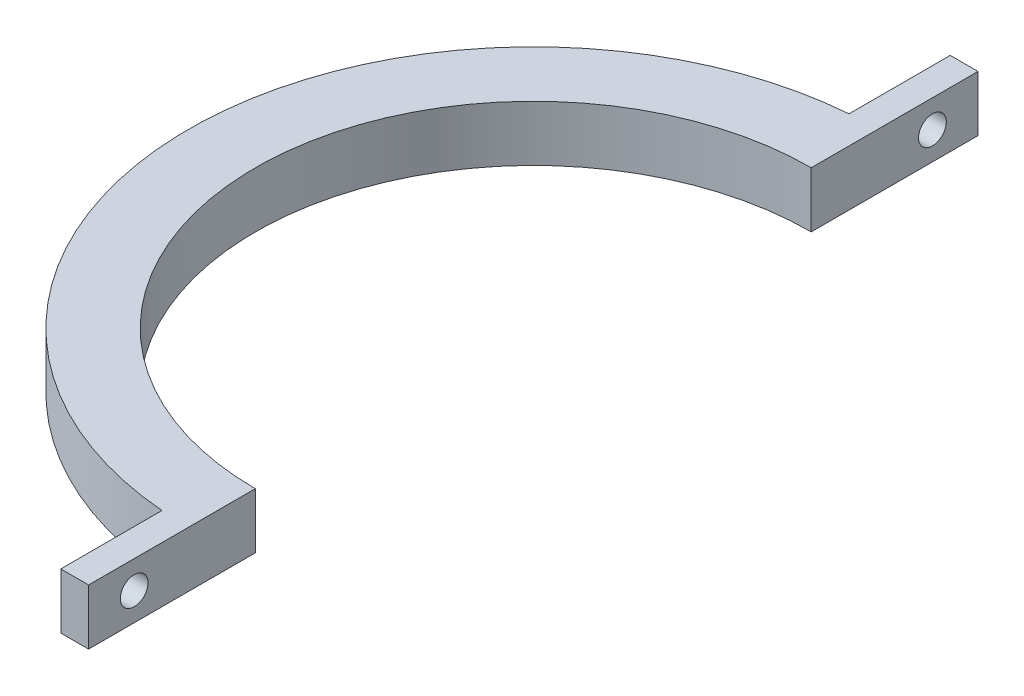
ISO-10303-21;
HEADER;
FILE_DESCRIPTION(('STEP AP214'),'2;1');
FILE_NAME('part.step','',(''),(''),'','','');
FILE_SCHEMA(('AUTOMOTIVE_DESIGN { 1 0 10303 214 1 1 1 1 }'));
ENDSEC;
DATA;
#1=APPLICATION_CONTEXT('core data for automotive mechanical design processes');
#2=APPLICATION_PROTOCOL_DEFINITION('international standard','automotive_design',2000,#1);
#3=PRODUCT_CONTEXT('',#1,'mechanical');
#4=PRODUCT('Part','Part','',(#3));
#5=PRODUCT_RELATED_PRODUCT_CATEGORY('part','',(#4));
#6=PRODUCT_DEFINITION_FORMATION('','',#4);
#7=PRODUCT_DEFINITION_CONTEXT('part definition',#1,'design');
#8=PRODUCT_DEFINITION('design','',#6,#7);
#9=PRODUCT_DEFINITION_SHAPE('','',#8);
#10=(LENGTH_UNIT() NAMED_UNIT(*) SI_UNIT(.MILLI.,.METRE.));
#11=(NAMED_UNIT(*) PLANE_ANGLE_UNIT() SI_UNIT($,.RADIAN.));
#12=(NAMED_UNIT(*) SI_UNIT($,.STERADIAN.) SOLID_ANGLE_UNIT());
#13=UNCERTAINTY_MEASURE_WITH_UNIT(LENGTH_MEASURE(1.E-05),#10,'distance_accuracy_value','');
#14=(GEOMETRIC_REPRESENTATION_CONTEXT(3) GLOBAL_UNCERTAINTY_ASSIGNED_CONTEXT((#13)) GLOBAL_UNIT_ASSIGNED_CONTEXT((#10,
#11,#12)) REPRESENTATION_CONTEXT('',''));
#15=CARTESIAN_POINT('',(0.,0.,0.));
#16=DIRECTION('',(0.,0.,1.));
#17=DIRECTION('',(1.,0.,0.));
#18=AXIS2_PLACEMENT_3D('',#15,#16,#17);
#19=CARTESIAN_POINT('',(0.,5.,0.));
#20=DIRECTION('',(0.,-1.,0.));
#21=DIRECTION('',(0.,0.,-1.));
#22=AXIS2_PLACEMENT_3D('',#19,#20,#21);
#23=CYLINDRICAL_SURFACE('',#22,25.);
#24=CARTESIAN_POINT('',(0.,0.,0.));
#25=DIRECTION('',(0.,1.,0.));
#26=DIRECTION('',(0.,0.,1.));
#27=AXIS2_PLACEMENT_3D('',#24,#25,#26);
#28=CIRCLE('',#27,25.);
#29=CARTESIAN_POINT('',(0.,0.,-25.));
#30=VERTEX_POINT('',#29);
#31=CARTESIAN_POINT('',(0.,0.,25.));
#32=VERTEX_POINT('',#31);
#33=EDGE_CURVE('E139',#30,#32,#28,.T.);
#34=ORIENTED_EDGE('',*,*,#33,.F.);
#35=DIRECTION('',(0.,-1.,0.));
#36=VECTOR('',#35,1.);
#37=CARTESIAN_POINT('',(0.,5.,-25.));
#38=LINE('',#37,#36);
#39=CARTESIAN_POINT('',(0.,5.,-25.));
#40=VERTEX_POINT('',#39);
#41=EDGE_CURVE('E11',#40,#30,#38,.T.);
#42=ORIENTED_EDGE('',*,*,#41,.F.);
#43=CARTESIAN_POINT('',(0.,5.,0.));
#44=DIRECTION('',(0.,1.,0.));
#45=DIRECTION('',(0.,0.,1.));
#46=AXIS2_PLACEMENT_3D('',#43,#44,#45);
#47=CIRCLE('',#46,25.);
#48=CARTESIAN_POINT('',(0.,5.,25.));
#49=VERTEX_POINT('',#48);
#50=EDGE_CURVE('E165',#40,#49,#47,.T.);
#51=ORIENTED_EDGE('',*,*,#50,.T.);
#52=DIRECTION('',(0.,-1.,0.));
#53=VECTOR('',#52,1.);
#54=CARTESIAN_POINT('',(0.,5.,25.));
#55=LINE('',#54,#53);
#56=EDGE_CURVE('E58',#49,#32,#55,.T.);
#57=ORIENTED_EDGE('',*,*,#56,.T.);
#58=EDGE_LOOP('',(#34,#42,#51,#57));
#59=FACE_BOUND('',#58,.T.);
#60=ADVANCED_FACE('F41',(#59),#23,.F.);
#61=CARTESIAN_POINT('',(0.,5.,0.));
#62=DIRECTION('',(-1.,0.,0.));
#63=DIRECTION('',(0.,0.,1.));
#64=AXIS2_PLACEMENT_3D('',#61,#62,#63);
#65=PLANE('',#64);
#66=CARTESIAN_POINT('',(0.,2.5,-35.8990291109608));
#67=DIRECTION('',(-1.,0.,0.));
#68=DIRECTION('',(0.,0.,1.));
#69=AXIS2_PLACEMENT_3D('',#66,#67,#68);
#70=CIRCLE('',#69,1.25);
#71=CARTESIAN_POINT('',(0.,2.5,-34.6490291109608));
#72=VERTEX_POINT('',#71);
#73=EDGE_CURVE('E143',#72,#72,#70,.T.);
#74=ORIENTED_EDGE('',*,*,#73,.T.);
#75=EDGE_LOOP('',(#74));
#76=FACE_BOUND('',#75,.T.);
#77=DIRECTION('',(0.,0.,-1.));
#78=VECTOR('',#77,1.);
#79=CARTESIAN_POINT('',(0.,0.,0.));
#80=LINE('',#79,#78);
#81=CARTESIAN_POINT('',(0.,0.,-40.));
#82=VERTEX_POINT('',#81);
#83=EDGE_CURVE('E142',#30,#82,#80,.T.);
#84=ORIENTED_EDGE('',*,*,#83,.T.);
#85=DIRECTION('',(0.,-1.,0.));
#86=VECTOR('',#85,1.);
#87=CARTESIAN_POINT('',(0.,5.,-40.));
#88=LINE('',#87,#86);
#89=CARTESIAN_POINT('',(0.,5.,-40.));
#90=VERTEX_POINT('',#89);
#91=EDGE_CURVE('E50',#90,#82,#88,.T.);
#92=ORIENTED_EDGE('',*,*,#91,.F.);
#93=DIRECTION('',(0.,0.,-1.));
#94=VECTOR('',#93,1.);
#95=CARTESIAN_POINT('',(0.,5.,0.));
#96=LINE('',#95,#94);
#97=EDGE_CURVE('E207',#40,#90,#96,.T.);
#98=ORIENTED_EDGE('',*,*,#97,.F.);
#99=ORIENTED_EDGE('',*,*,#41,.T.);
#100=EDGE_LOOP('',(#84,#92,#98,#99));
#101=FACE_BOUND('',#100,.T.);
#102=ADVANCED_FACE('F228',(#76,#101),#65,.F.);
#103=CARTESIAN_POINT('',(0.,5.,-40.));
#104=DIRECTION('',(0.,0.,1.));
#105=DIRECTION('',(1.,0.,0.));
#106=AXIS2_PLACEMENT_3D('',#103,#104,#105);
#107=PLANE('',#106);
#108=DIRECTION('',(-1.,0.,0.));
#109=VECTOR('',#108,1.);
#110=CARTESIAN_POINT('',(0.,0.,-40.));
#111=LINE('',#110,#109);
#112=CARTESIAN_POINT('',(-2.5,0.,-40.));
#113=VERTEX_POINT('',#112);
#114=EDGE_CURVE('E146',#82,#113,#111,.T.);
#115=ORIENTED_EDGE('',*,*,#114,.T.);
#116=DIRECTION('',(0.,-1.,0.));
#117=VECTOR('',#116,1.);
#118=CARTESIAN_POINT('',(-2.5,5.,-40.));
#119=LINE('',#118,#117);
#120=CARTESIAN_POINT('',(-2.5,5.,-40.));
#121=VERTEX_POINT('',#120);
#122=EDGE_CURVE('E176',#121,#113,#119,.T.);
#123=ORIENTED_EDGE('',*,*,#122,.F.);
#124=DIRECTION('',(-1.,0.,0.));
#125=VECTOR('',#124,1.);
#126=CARTESIAN_POINT('',(0.,5.,-40.));
#127=LINE('',#126,#125);
#128=EDGE_CURVE('E187',#90,#121,#127,.T.);
#129=ORIENTED_EDGE('',*,*,#128,.F.);
#130=ORIENTED_EDGE('',*,*,#91,.T.);
#131=EDGE_LOOP('',(#115,#123,#129,#130));
#132=FACE_BOUND('',#131,.T.);
#133=ADVANCED_FACE('F185',(#132),#107,.F.);
#134=CARTESIAN_POINT('',(-2.5,5.,0.));
#135=DIRECTION('',(1.,0.,0.));
#136=DIRECTION('',(0.,0.,-1.));
#137=AXIS2_PLACEMENT_3D('',#134,#135,#136);
#138=PLANE('',#137);
#139=CARTESIAN_POINT('',(-2.5,2.5,-35.8990291109608));
#140=DIRECTION('',(-1.,0.,0.));
#141=DIRECTION('',(0.,0.,1.));
#142=AXIS2_PLACEMENT_3D('',#139,#140,#141);
#143=CIRCLE('',#142,1.25);
#144=CARTESIAN_POINT('',(-2.5,2.5,-34.6490291109608));
#145=VERTEX_POINT('',#144);
#146=EDGE_CURVE('E220',#145,#145,#143,.T.);
#147=ORIENTED_EDGE('',*,*,#146,.F.);
#148=EDGE_LOOP('',(#147));
#149=FACE_BOUND('',#148,.T.);
#150=DIRECTION('',(0.,0.,1.));
#151=VECTOR('',#150,1.);
#152=CARTESIAN_POINT('',(-2.5,0.,0.));
#153=LINE('',#152,#151);
#154=CARTESIAN_POINT('',(-2.5,0.,-30.8990291109608));
#155=VERTEX_POINT('',#154);
#156=EDGE_CURVE('E149',#113,#155,#153,.T.);
#157=ORIENTED_EDGE('',*,*,#156,.T.);
#158=DIRECTION('',(0.,-1.,0.));
#159=VECTOR('',#158,1.);
#160=CARTESIAN_POINT('',(-2.5,5.,-30.8990291109608));
#161=LINE('',#160,#159);
#162=CARTESIAN_POINT('',(-2.5,5.,-30.8990291109608));
#163=VERTEX_POINT('',#162);
#164=EDGE_CURVE('E172',#163,#155,#161,.T.);
#165=ORIENTED_EDGE('',*,*,#164,.F.);
#166=DIRECTION('',(0.,0.,1.));
#167=VECTOR('',#166,1.);
#168=CARTESIAN_POINT('',(-2.5,5.,0.));
#169=LINE('',#168,#167);
#170=EDGE_CURVE('E201',#121,#163,#169,.T.);
#171=ORIENTED_EDGE('',*,*,#170,.F.);
#172=ORIENTED_EDGE('',*,*,#122,.T.);
#173=EDGE_LOOP('',(#157,#165,#171,#172));
#174=FACE_BOUND('',#173,.T.);
#175=ADVANCED_FACE('F196',(#149,#174),#138,.F.);
#176=CARTESIAN_POINT('',(0.,5.,0.));
#177=DIRECTION('',(0.,-1.,0.));
#178=DIRECTION('',(0.,0.,-1.));
#179=AXIS2_PLACEMENT_3D('',#176,#177,#178);
#180=CYLINDRICAL_SURFACE('',#179,31.);
#181=CARTESIAN_POINT('',(0.,0.,0.));
#182=DIRECTION('',(0.,1.,0.));
#183=DIRECTION('',(0.,0.,1.));
#184=AXIS2_PLACEMENT_3D('',#181,#182,#183);
#185=CIRCLE('',#184,31.);
#186=CARTESIAN_POINT('',(-2.5,0.,30.8990291109608));
#187=VERTEX_POINT('',#186);
#188=EDGE_CURVE('E152',#155,#187,#185,.T.);
#189=ORIENTED_EDGE('',*,*,#188,.T.);
#190=DIRECTION('',(0.,-1.,0.));
#191=VECTOR('',#190,1.);
#192=CARTESIAN_POINT('',(-2.5,5.,30.8990291109608));
#193=LINE('',#192,#191);
#194=CARTESIAN_POINT('',(-2.5,5.,30.8990291109608));
#195=VERTEX_POINT('',#194);
#196=EDGE_CURVE('E118',#195,#187,#193,.T.);
#197=ORIENTED_EDGE('',*,*,#196,.F.);
#198=CARTESIAN_POINT('',(0.,5.,0.));
#199=DIRECTION('',(0.,1.,0.));
#200=DIRECTION('',(0.,0.,1.));
#201=AXIS2_PLACEMENT_3D('',#198,#199,#200);
#202=CIRCLE('',#201,31.);
#203=EDGE_CURVE('E127',#163,#195,#202,.T.);
#204=ORIENTED_EDGE('',*,*,#203,.F.);
#205=ORIENTED_EDGE('',*,*,#164,.T.);
#206=EDGE_LOOP('',(#189,#197,#204,#205));
#207=FACE_BOUND('',#206,.T.);
#208=ADVANCED_FACE('F199',(#207),#180,.T.);
#209=CARTESIAN_POINT('',(-2.5,5.,0.));
#210=DIRECTION('',(-1.,0.,0.));
#211=DIRECTION('',(0.,0.,1.));
#212=AXIS2_PLACEMENT_3D('',#209,#210,#211);
#213=PLANE('',#212);
#214=CARTESIAN_POINT('',(-2.5,2.5,35.8990291109608));
#215=DIRECTION('',(-1.,0.,0.));
#216=DIRECTION('',(0.,0.,-1.));
#217=AXIS2_PLACEMENT_3D('',#214,#215,#216);
#218=CIRCLE('',#217,1.25);
#219=CARTESIAN_POINT('',(-2.5,2.5,34.6490291109608));
#220=VERTEX_POINT('',#219);
#221=EDGE_CURVE('E212',#220,#220,#218,.T.);
#222=ORIENTED_EDGE('',*,*,#221,.F.);
#223=EDGE_LOOP('',(#222));
#224=FACE_BOUND('',#223,.T.);
#225=DIRECTION('',(0.,0.,-1.));
#226=VECTOR('',#225,1.);
#227=CARTESIAN_POINT('',(-2.5,0.,0.));
#228=LINE('',#227,#226);
#229=CARTESIAN_POINT('',(-2.5,0.,40.));
#230=VERTEX_POINT('',#229);
#231=EDGE_CURVE('E113',#230,#187,#228,.T.);
#232=ORIENTED_EDGE('',*,*,#231,.F.);
#233=DIRECTION('',(0.,-1.,0.));
#234=VECTOR('',#233,1.);
#235=CARTESIAN_POINT('',(-2.5,5.,40.));
#236=LINE('',#235,#234);
#237=CARTESIAN_POINT('',(-2.5,5.,40.));
#238=VERTEX_POINT('',#237);
#239=EDGE_CURVE('E108',#238,#230,#236,.T.);
#240=ORIENTED_EDGE('',*,*,#239,.F.);
#241=DIRECTION('',(0.,0.,-1.));
#242=VECTOR('',#241,1.);
#243=CARTESIAN_POINT('',(-2.5,5.,0.));
#244=LINE('',#243,#242);
#245=EDGE_CURVE('E111',#238,#195,#244,.T.);
#246=ORIENTED_EDGE('',*,*,#245,.T.);
#247=ORIENTED_EDGE('',*,*,#196,.T.);
#248=EDGE_LOOP('',(#232,#240,#246,#247));
#249=FACE_BOUND('',#248,.T.);
#250=ADVANCED_FACE('F110',(#224,#249),#213,.T.);
#251=CARTESIAN_POINT('',(0.,5.,40.));
#252=DIRECTION('',(0.,0.,1.));
#253=DIRECTION('',(1.,0.,0.));
#254=AXIS2_PLACEMENT_3D('',#251,#252,#253);
#255=PLANE('',#254);
#256=DIRECTION('',(-1.,0.,0.));
#257=VECTOR('',#256,1.);
#258=CARTESIAN_POINT('',(0.,0.,40.));
#259=LINE('',#258,#257);
#260=CARTESIAN_POINT('',(0.,0.,40.));
#261=VERTEX_POINT('',#260);
#262=EDGE_CURVE('E158',#261,#230,#259,.T.);
#263=ORIENTED_EDGE('',*,*,#262,.F.);
#264=DIRECTION('',(0.,-1.,0.));
#265=VECTOR('',#264,1.);
#266=CARTESIAN_POINT('',(0.,5.,40.));
#267=LINE('',#266,#265);
#268=CARTESIAN_POINT('',(0.,5.,40.));
#269=VERTEX_POINT('',#268);
#270=EDGE_CURVE('E83',#269,#261,#267,.T.);
#271=ORIENTED_EDGE('',*,*,#270,.F.);
#272=DIRECTION('',(-1.,0.,0.));
#273=VECTOR('',#272,1.);
#274=CARTESIAN_POINT('',(0.,5.,40.));
#275=LINE('',#274,#273);
#276=EDGE_CURVE('E125',#269,#238,#275,.T.);
#277=ORIENTED_EDGE('',*,*,#276,.T.);
#278=ORIENTED_EDGE('',*,*,#239,.T.);
#279=EDGE_LOOP('',(#263,#271,#277,#278));
#280=FACE_BOUND('',#279,.T.);
#281=ADVANCED_FACE('F131',(#280),#255,.T.);
#282=CARTESIAN_POINT('',(0.,5.,0.));
#283=DIRECTION('',(1.,0.,0.));
#284=DIRECTION('',(0.,0.,-1.));
#285=AXIS2_PLACEMENT_3D('',#282,#283,#284);
#286=PLANE('',#285);
#287=CARTESIAN_POINT('',(0.,2.5,35.8990291109608));
#288=DIRECTION('',(-1.,0.,0.));
#289=DIRECTION('',(0.,0.,-1.));
#290=AXIS2_PLACEMENT_3D('',#287,#288,#289);
#291=CIRCLE('',#290,1.25);
#292=CARTESIAN_POINT('',(0.,2.5,34.6490291109608));
#293=VERTEX_POINT('',#292);
#294=EDGE_CURVE('E216',#293,#293,#291,.T.);
#295=ORIENTED_EDGE('',*,*,#294,.T.);
#296=EDGE_LOOP('',(#295));
#297=FACE_BOUND('',#296,.T.);
#298=DIRECTION('',(0.,0.,1.));
#299=VECTOR('',#298,1.);
#300=CARTESIAN_POINT('',(0.,0.,0.));
#301=LINE('',#300,#299);
#302=EDGE_CURVE('E161',#32,#261,#301,.T.);
#303=ORIENTED_EDGE('',*,*,#302,.F.);
#304=ORIENTED_EDGE('',*,*,#56,.F.);
#305=DIRECTION('',(0.,0.,1.));
#306=VECTOR('',#305,1.);
#307=CARTESIAN_POINT('',(0.,5.,0.));
#308=LINE('',#307,#306);
#309=EDGE_CURVE('E133',#49,#269,#308,.T.);
#310=ORIENTED_EDGE('',*,*,#309,.T.);
#311=ORIENTED_EDGE('',*,*,#270,.T.);
#312=EDGE_LOOP('',(#303,#304,#310,#311));
#313=FACE_BOUND('',#312,.T.);
#314=ADVANCED_FACE('F249',(#297,#313),#286,.T.);
#315=CARTESIAN_POINT('',(0.,5.,0.));
#316=DIRECTION('',(0.,1.,0.));
#317=DIRECTION('',(0.,0.,1.));
#318=AXIS2_PLACEMENT_3D('',#315,#316,#317);
#319=PLANE('',#318);
#320=ORIENTED_EDGE('',*,*,#50,.F.);
#321=ORIENTED_EDGE('',*,*,#97,.T.);
#322=ORIENTED_EDGE('',*,*,#128,.T.);
#323=ORIENTED_EDGE('',*,*,#170,.T.);
#324=ORIENTED_EDGE('',*,*,#203,.T.);
#325=ORIENTED_EDGE('',*,*,#245,.F.);
#326=ORIENTED_EDGE('',*,*,#276,.F.);
#327=ORIENTED_EDGE('',*,*,#309,.F.);
#328=EDGE_LOOP('',(#320,#321,#322,#323,#324,#325,#326,#327));
#329=FACE_BOUND('',#328,.T.);
#330=ADVANCED_FACE('F123',(#329),#319,.T.);
#331=CARTESIAN_POINT('',(0.,0.,0.));
#332=DIRECTION('',(0.,1.,0.));
#333=DIRECTION('',(0.,0.,1.));
#334=AXIS2_PLACEMENT_3D('',#331,#332,#333);
#335=PLANE('',#334);
#336=ORIENTED_EDGE('',*,*,#33,.T.);
#337=ORIENTED_EDGE('',*,*,#302,.T.);
#338=ORIENTED_EDGE('',*,*,#262,.T.);
#339=ORIENTED_EDGE('',*,*,#231,.T.);
#340=ORIENTED_EDGE('',*,*,#188,.F.);
#341=ORIENTED_EDGE('',*,*,#156,.F.);
#342=ORIENTED_EDGE('',*,*,#114,.F.);
#343=ORIENTED_EDGE('',*,*,#83,.F.);
#344=EDGE_LOOP('',(#336,#337,#338,#339,#340,#341,#342,#343));
#345=FACE_BOUND('',#344,.T.);
#346=ADVANCED_FACE('F192',(#345),#335,.F.);
#347=CARTESIAN_POINT('',(0.,2.5,35.8990291109608));
#348=DIRECTION('',(-1.,0.,0.));
#349=DIRECTION('',(0.,0.,1.));
#350=AXIS2_PLACEMENT_3D('',#347,#348,#349);
#351=CYLINDRICAL_SURFACE('',#350,1.25);
#352=ORIENTED_EDGE('',*,*,#294,.F.);
#353=EDGE_LOOP('',(#352));
#354=FACE_BOUND('',#353,.T.);
#355=ORIENTED_EDGE('',*,*,#221,.T.);
#356=EDGE_LOOP('',(#355));
#357=FACE_BOUND('',#356,.T.);
#358=ADVANCED_FACE('F233',(#354,#357),#351,.F.);
#359=CARTESIAN_POINT('',(0.,2.5,-35.8990291109608));
#360=DIRECTION('',(-1.,0.,0.));
#361=DIRECTION('',(0.,0.,1.));
#362=AXIS2_PLACEMENT_3D('',#359,#360,#361);
#363=CYLINDRICAL_SURFACE('',#362,1.25);
#364=ORIENTED_EDGE('',*,*,#73,.F.);
#365=EDGE_LOOP('',(#364));
#366=FACE_BOUND('',#365,.T.);
#367=ORIENTED_EDGE('',*,*,#146,.T.);
#368=EDGE_LOOP('',(#367));
#369=FACE_BOUND('',#368,.T.);
#370=ADVANCED_FACE('F230',(#366,#369),#363,.F.);
#371=CLOSED_SHELL('',(#60,#102,#133,#175,#208,#250,#281,#314,#330,#346,#358,#370));
#372=MANIFOLD_SOLID_BREP('B2',#371);
#373=ADVANCED_BREP_SHAPE_REPRESENTATION('',(#18,#372),#14);
#374=SHAPE_DEFINITION_REPRESENTATION(#9,#373);
ENDSEC;
END-ISO-10303-21;
